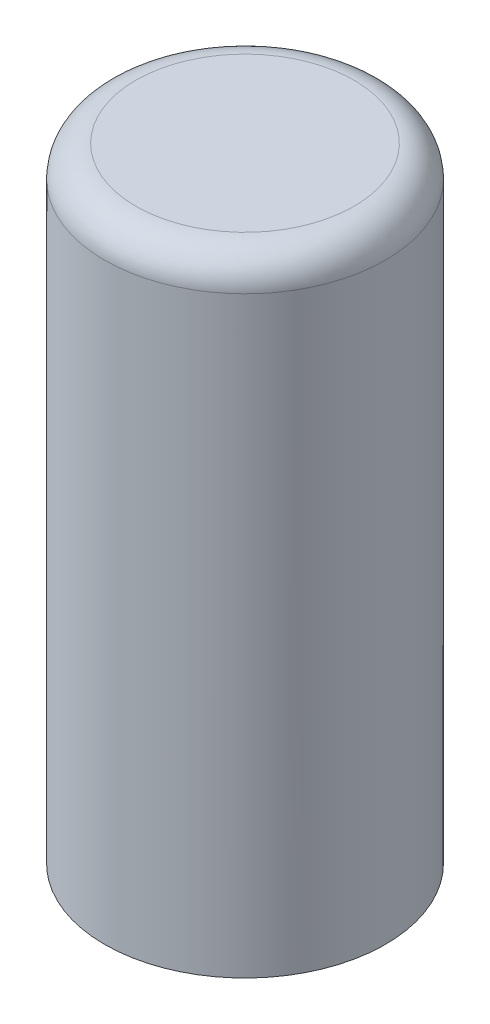
ISO-10303-21;
HEADER;
FILE_DESCRIPTION(('STEP AP214'),'2;1');
FILE_NAME('part.step','',(''),(''),'','','');
FILE_SCHEMA(('AUTOMOTIVE_DESIGN { 1 0 10303 214 1 1 1 1 }'));
ENDSEC;
DATA;
#1=APPLICATION_CONTEXT('core data for automotive mechanical design processes');
#2=APPLICATION_PROTOCOL_DEFINITION('international standard','automotive_design',2000,#1);
#3=PRODUCT_CONTEXT('',#1,'mechanical');
#4=PRODUCT('Part','Part','',(#3));
#5=PRODUCT_RELATED_PRODUCT_CATEGORY('part','',(#4));
#6=PRODUCT_DEFINITION_FORMATION('','',#4);
#7=PRODUCT_DEFINITION_CONTEXT('part definition',#1,'design');
#8=PRODUCT_DEFINITION('design','',#6,#7);
#9=PRODUCT_DEFINITION_SHAPE('','',#8);
#10=(LENGTH_UNIT() NAMED_UNIT(*) SI_UNIT(.MILLI.,.METRE.));
#11=(NAMED_UNIT(*) PLANE_ANGLE_UNIT() SI_UNIT($,.RADIAN.));
#12=(NAMED_UNIT(*) SI_UNIT($,.STERADIAN.) SOLID_ANGLE_UNIT());
#13=UNCERTAINTY_MEASURE_WITH_UNIT(LENGTH_MEASURE(1.E-05),#10,'distance_accuracy_value','');
#14=(GEOMETRIC_REPRESENTATION_CONTEXT(3) GLOBAL_UNCERTAINTY_ASSIGNED_CONTEXT((#13)) GLOBAL_UNIT_ASSIGNED_CONTEXT((#10,
#11,#12)) REPRESENTATION_CONTEXT('',''));
#15=CARTESIAN_POINT('',(0.,0.,0.));
#16=DIRECTION('',(0.,0.,1.));
#17=DIRECTION('',(1.,0.,0.));
#18=AXIS2_PLACEMENT_3D('',#15,#16,#17);
#19=CARTESIAN_POINT('',(0.,-20.,0.));
#20=DIRECTION('',(0.,1.,0.));
#21=DIRECTION('',(0.,0.,1.));
#22=AXIS2_PLACEMENT_3D('',#19,#20,#21);
#23=CYLINDRICAL_SURFACE('',#22,3.);
#24=CARTESIAN_POINT('',(0.,-20.,0.));
#25=DIRECTION('',(0.,1.,0.));
#26=DIRECTION('',(0.,0.,1.));
#27=AXIS2_PLACEMENT_3D('',#24,#25,#26);
#28=CIRCLE('',#27,3.);
#29=CARTESIAN_POINT('',(0.,-20.,3.));
#30=VERTEX_POINT('',#29);
#31=EDGE_CURVE('E80',#30,#30,#28,.T.);
#32=ORIENTED_EDGE('',*,*,#31,.F.);
#33=EDGE_LOOP('',(#32));
#34=FACE_BOUND('',#33,.T.);
#35=CARTESIAN_POINT('',(0.,-2.,0.));
#36=DIRECTION('',(0.,1.,0.));
#37=DIRECTION('',(0.,0.,1.));
#38=AXIS2_PLACEMENT_3D('',#35,#36,#37);
#39=CIRCLE('',#38,3.);
#40=CARTESIAN_POINT('',(0.,-2.,3.));
#41=VERTEX_POINT('',#40);
#42=EDGE_CURVE('E68',#41,#41,#39,.F.);
#43=ORIENTED_EDGE('',*,*,#42,.F.);
#44=EDGE_LOOP('',(#43));
#45=FACE_BOUND('',#44,.T.);
#46=ADVANCED_FACE('F48',(#34,#45),#23,.F.);
#47=CARTESIAN_POINT('',(0.,-20.,0.));
#48=DIRECTION('',(0.,1.,0.));
#49=DIRECTION('',(0.,0.,1.));
#50=AXIS2_PLACEMENT_3D('',#47,#48,#49);
#51=CYLINDRICAL_SURFACE('',#50,4.5);
#52=CARTESIAN_POINT('',(0.,-1.,4.5));
#53=CARTESIAN_POINT('',(0.589048617699849,-1.,4.5));
#54=CARTESIAN_POINT('',(1.17786548409566,-1.,4.3828770431522));
#55=CARTESIAN_POINT('',(2.26628540719015,-1.,3.93203874944938));
#56=CARTESIAN_POINT('',(2.76546024331536,-1.,3.59850078736357));
#57=CARTESIAN_POINT('',(3.59850078736357,-1.,2.76546024331536));
#58=CARTESIAN_POINT('',(3.93203874944955,-1.,2.26628540718974));
#59=CARTESIAN_POINT('',(4.38287704315203,-1.,1.17786548409606));
#60=CARTESIAN_POINT('',(4.5,-1.,0.58904861769995));
#61=CARTESIAN_POINT('',(4.5,-1.,-0.589048617699949));
#62=CARTESIAN_POINT('',(4.38287704315209,-1.,-1.17786548409592));
#63=CARTESIAN_POINT('',(3.93203874944949,-1.,-2.26628540718989));
#64=CARTESIAN_POINT('',(3.59850078736374,-1.,-2.76546024331519));
#65=CARTESIAN_POINT('',(2.76546024331519,-1.,-3.59850078736374));
#66=CARTESIAN_POINT('',(2.26628540718999,-1.,-3.93203874944945));
#67=CARTESIAN_POINT('',(1.17786548409583,-1.,-4.38287704315213));
#68=CARTESIAN_POINT('',(0.589048617699361,-1.,-4.5));
#69=CARTESIAN_POINT('',(-0.58904861769936,-1.,-4.5));
#70=CARTESIAN_POINT('',(-1.17786548409587,-1.,-4.38287704315211));
#71=CARTESIAN_POINT('',(-2.26628540718992,-1.,-3.93203874944948));
#72=CARTESIAN_POINT('',(-2.7654602433157,-1.,-3.59850078736323));
#73=CARTESIAN_POINT('',(-3.59850078736323,-1.,-2.7654602433157));
#74=CARTESIAN_POINT('',(-3.93203874944944,-1.,-2.26628540719));
#75=CARTESIAN_POINT('',(-4.38287704315214,-1.,-1.17786548409582));
#76=CARTESIAN_POINT('',(-4.5,-1.,-0.589048617699943));
#77=CARTESIAN_POINT('',(-4.5,-1.,0.589048617699957));
#78=CARTESIAN_POINT('',(-4.38287704315215,-1.,1.17786548409578));
#79=CARTESIAN_POINT('',(-3.93203874944944,-1.,2.26628540719001));
#80=CARTESIAN_POINT('',(-3.59850078736369,-1.,2.76546024331524));
#81=CARTESIAN_POINT('',(-2.76546024331526,-1.,3.59850078736367));
#82=CARTESIAN_POINT('',(-2.26628540719006,-1.,3.93203874944942));
#83=CARTESIAN_POINT('',(-1.17786548409576,-1.,4.38287704315216));
#84=CARTESIAN_POINT('',(-0.58904861769985,-1.,4.5));
#85=CARTESIAN_POINT('',(0.,-1.,4.5));
#86=(BOUNDED_CURVE() B_SPLINE_CURVE(3,(#52,#53,#54,#55,#56,#57,#58,#59,#60,#61,#62,#63,#64,#65,
#66,#67,#68,#69,#70,#71,#72,#73,#74,#75,#76,#77,#78,#79,#80,#81,#82,#83,#84,#85),.UNSPECIFIED.,
.T.,.F.) B_SPLINE_CURVE_WITH_KNOTS((4,2,2,2,2,2,2,2,2,2,2,2,2,2,2,2,4),(0.,0.392699081698724,
0.785398163397448,1.17809724509617,1.5707963267949,1.96349540849362,2.35619449019234,
2.74889357189107,3.14159265358979,3.53429173528852,3.92699081698724,4.31968989868597,
4.71238898038469,5.10508806208341,5.49778714378214,5.89048622548086,6.28318530717959),
.UNSPECIFIED.) CURVE() GEOMETRIC_REPRESENTATION_ITEM() RATIONAL_B_SPLINE_CURVE((1.,1.,1.,1.,1.,
1.,1.,1.,1.,1.,1.,1.,1.,1.,1.,1.,1.,1.,1.,1.,1.,1.,1.,1.,1.,1.,1.,1.,1.,1.,1.,1.,1.,1.)) REPRESENTATION_ITEM(''));
#87=CARTESIAN_POINT('',(0.,-1.,4.5));
#88=VERTEX_POINT('',#87);
#89=EDGE_CURVE('E11',#88,#88,#86,.F.);
#90=ORIENTED_EDGE('',*,*,#89,.T.);
#91=EDGE_LOOP('',(#90));
#92=FACE_BOUND('',#91,.T.);
#93=CARTESIAN_POINT('',(0.,-20.,0.));
#94=DIRECTION('',(0.,1.,0.));
#95=DIRECTION('',(0.,0.,1.));
#96=AXIS2_PLACEMENT_3D('',#93,#94,#95);
#97=CIRCLE('',#96,4.5);
#98=CARTESIAN_POINT('',(0.,-20.,4.5));
#99=VERTEX_POINT('',#98);
#100=EDGE_CURVE('E74',#99,#99,#97,.T.);
#101=ORIENTED_EDGE('',*,*,#100,.T.);
#102=EDGE_LOOP('',(#101));
#103=FACE_BOUND('',#102,.T.);
#104=ADVANCED_FACE('F100',(#92,#103),#51,.T.);
#105=CARTESIAN_POINT('',(0.,-20.,0.));
#106=DIRECTION('',(0.,1.,0.));
#107=DIRECTION('',(0.,0.,1.));
#108=AXIS2_PLACEMENT_3D('',#105,#106,#107);
#109=PLANE('',#108);
#110=ORIENTED_EDGE('',*,*,#31,.T.);
#111=EDGE_LOOP('',(#110));
#112=FACE_BOUND('',#111,.T.);
#113=ORIENTED_EDGE('',*,*,#100,.F.);
#114=EDGE_LOOP('',(#113));
#115=FACE_BOUND('',#114,.T.);
#116=ADVANCED_FACE('F98',(#112,#115),#109,.F.);
#117=CARTESIAN_POINT('',(0.,0.,0.));
#118=DIRECTION('',(0.,1.,0.));
#119=DIRECTION('',(0.,0.,1.));
#120=AXIS2_PLACEMENT_3D('',#117,#118,#119);
#121=PLANE('',#120);
#122=CARTESIAN_POINT('',(0.,0.,3.5));
#123=CARTESIAN_POINT('',(-0.458148924877661,0.,3.50000000000013));
#124=CARTESIAN_POINT('',(-0.916117598741248,0.,3.40890436689621));
#125=CARTESIAN_POINT('',(-1.76266642781439,0.,3.0582523606828));
#126=CARTESIAN_POINT('',(-2.15091352257853,0.,2.7988339457273));
#127=CARTESIAN_POINT('',(-2.79883394572732,0.,2.15091352257851));
#128=CARTESIAN_POINT('',(-3.05825236068306,0.,1.76266642781438));
#129=CARTESIAN_POINT('',(-3.40890436689596,0.,0.916117598741238));
#130=CARTESIAN_POINT('',(-3.5,0.,0.458148924877745));
#131=CARTESIAN_POINT('',(-3.5,0.,-0.458148924877733));
#132=CARTESIAN_POINT('',(-3.40890436689621,0.,-0.916117598741248));
#133=CARTESIAN_POINT('',(-3.0582523606828,0.,-1.76266642781439));
#134=CARTESIAN_POINT('',(-2.79883394572718,0.,-2.15091352257853));
#135=CARTESIAN_POINT('',(-2.15091352257866,0.,-2.7988339457273));
#136=CARTESIAN_POINT('',(-1.76266642781443,0.,-3.0582523606829));
#137=CARTESIAN_POINT('',(-0.916117598741191,0.,-3.40890436689612));
#138=CARTESIAN_POINT('',(-0.458148924877738,0.,-3.5));
#139=CARTESIAN_POINT('',(0.458148924877739,0.,-3.5));
#140=CARTESIAN_POINT('',(0.9161175987412,0.,-3.40890436689611));
#141=CARTESIAN_POINT('',(1.76266642781444,0.,-3.05825236068289));
#142=CARTESIAN_POINT('',(2.15091352257853,0.,-2.79883394572731));
#143=CARTESIAN_POINT('',(2.7988339457273,0.,-2.15091352257853));
#144=CARTESIAN_POINT('',(3.05825236068285,0.,-1.76266642781435));
#145=CARTESIAN_POINT('',(3.40890436689616,0.,-0.916117598741285));
#146=CARTESIAN_POINT('',(3.49999999999987,0.,-0.458148924877738));
#147=CARTESIAN_POINT('',(3.50000000000013,0.,0.458148924877739));
#148=CARTESIAN_POINT('',(3.40890436689604,0.,0.916117598741282));
#149=CARTESIAN_POINT('',(3.05825236068298,0.,1.76266642781434));
#150=CARTESIAN_POINT('',(2.79883394572721,0.,2.15091352257862));
#151=CARTESIAN_POINT('',(2.15091352257862,0.,2.79883394572721));
#152=CARTESIAN_POINT('',(1.76266642781452,0.,3.05825236068293));
#153=CARTESIAN_POINT('',(0.916117598741112,0.,3.40890436689607));
#154=CARTESIAN_POINT('',(0.458148924877661,0.,3.49999999999987));
#155=CARTESIAN_POINT('',(0.,0.,3.5));
#156=(BOUNDED_CURVE() B_SPLINE_CURVE(3,(#122,#123,#124,#125,#126,#127,#128,#129,#130,#131,#132,
#133,#134,#135,#136,#137,#138,#139,#140,#141,#142,#143,#144,#145,#146,#147,#148,#149,#150,#151,
#152,#153,#154,#155),.UNSPECIFIED.,.T.,.F.) B_SPLINE_CURVE_WITH_KNOTS((4,2,2,2,2,2,2,2,2,2,2,2,
2,2,2,2,4),(0.,0.392699081698725,0.785398163397448,1.17809724509617,1.5707963267949,
1.96349540849362,2.35619449019234,2.74889357189107,3.14159265358979,3.53429173528852,
3.92699081698724,4.31968989868597,4.71238898038469,5.10508806208341,5.49778714378214,
5.89048622548086,6.28318530717959),
.UNSPECIFIED.) CURVE() GEOMETRIC_REPRESENTATION_ITEM() RATIONAL_B_SPLINE_CURVE((1.,1.,1.,1.,1.,
1.,1.,1.,1.,1.,1.,1.,1.,1.,1.,1.,1.,1.,1.,1.,1.,1.,1.,1.,1.,1.,1.,1.,1.,1.,1.,1.,1.,1.)) REPRESENTATION_ITEM(''));
#157=CARTESIAN_POINT('',(0.,0.,3.5));
#158=VERTEX_POINT('',#157);
#159=EDGE_CURVE('E62',#158,#158,#156,.F.);
#160=ORIENTED_EDGE('',*,*,#159,.T.);
#161=EDGE_LOOP('',(#160));
#162=FACE_BOUND('',#161,.T.);
#163=ADVANCED_FACE('F88',(#162),#121,.T.);
#164=CARTESIAN_POINT('',(0.,-2.,0.));
#165=DIRECTION('',(0.,1.,0.));
#166=DIRECTION('',(0.,0.,1.));
#167=AXIS2_PLACEMENT_3D('',#164,#165,#166);
#168=PLANE('',#167);
#169=ORIENTED_EDGE('',*,*,#42,.T.);
#170=EDGE_LOOP('',(#169));
#171=FACE_BOUND('',#170,.T.);
#172=ADVANCED_FACE('F97',(#171),#168,.F.);
#173=CARTESIAN_POINT('',(0.,0.,3.5));
#174=CARTESIAN_POINT('',(0.458148924877661,0.,3.49999999999987));
#175=CARTESIAN_POINT('',(0.916117598741112,0.,3.40890436689607));
#176=CARTESIAN_POINT('',(1.76266642781452,0.,3.05825236068293));
#177=CARTESIAN_POINT('',(2.15091352257862,0.,2.79883394572721));
#178=CARTESIAN_POINT('',(2.79883394572721,0.,2.15091352257862));
#179=CARTESIAN_POINT('',(3.05825236068298,0.,1.76266642781434));
#180=CARTESIAN_POINT('',(3.40890436689604,0.,0.916117598741282));
#181=CARTESIAN_POINT('',(3.50000000000013,0.,0.458148924877739));
#182=CARTESIAN_POINT('',(3.49999999999987,0.,-0.458148924877738));
#183=CARTESIAN_POINT('',(3.40890436689616,0.,-0.916117598741285));
#184=CARTESIAN_POINT('',(3.05825236068285,0.,-1.76266642781435));
#185=CARTESIAN_POINT('',(2.7988339457273,0.,-2.15091352257853));
#186=CARTESIAN_POINT('',(2.15091352257853,0.,-2.79883394572731));
#187=CARTESIAN_POINT('',(1.76266642781444,0.,-3.05825236068289));
#188=CARTESIAN_POINT('',(0.9161175987412,0.,-3.40890436689611));
#189=CARTESIAN_POINT('',(0.458148924877739,0.,-3.5));
#190=CARTESIAN_POINT('',(-0.458148924877738,0.,-3.5));
#191=CARTESIAN_POINT('',(-0.916117598741191,0.,-3.40890436689612));
#192=CARTESIAN_POINT('',(-1.76266642781443,0.,-3.0582523606829));
#193=CARTESIAN_POINT('',(-2.15091352257866,0.,-2.7988339457273));
#194=CARTESIAN_POINT('',(-2.79883394572718,0.,-2.15091352257853));
#195=CARTESIAN_POINT('',(-3.0582523606828,0.,-1.76266642781439));
#196=CARTESIAN_POINT('',(-3.40890436689621,0.,-0.916117598741248));
#197=CARTESIAN_POINT('',(-3.5,0.,-0.458148924877733));
#198=CARTESIAN_POINT('',(-3.5,0.,0.458148924877745));
#199=CARTESIAN_POINT('',(-3.40890436689596,0.,0.916117598741238));
#200=CARTESIAN_POINT('',(-3.05825236068306,0.,1.76266642781438));
#201=CARTESIAN_POINT('',(-2.79883394572732,0.,2.15091352257851));
#202=CARTESIAN_POINT('',(-2.15091352257853,0.,2.7988339457273));
#203=CARTESIAN_POINT('',(-1.76266642781439,0.,3.0582523606828));
#204=CARTESIAN_POINT('',(-0.916117598741248,0.,3.40890436689621));
#205=CARTESIAN_POINT('',(-0.458148924877661,0.,3.50000000000013));
#206=CARTESIAN_POINT('',(0.,0.,3.5));
#207=CARTESIAN_POINT('',(0.,0.,4.5));
#208=CARTESIAN_POINT('',(0.58904861769985,1.2816324012224E-13,4.49999999999975));
#209=CARTESIAN_POINT('',(1.17786548409576,0.,4.38287704315228));
#210=CARTESIAN_POINT('',(2.26628540719005,0.,3.9320387494493));
#211=CARTESIAN_POINT('',(2.7654602433153,0.,3.5985007873635));
#212=CARTESIAN_POINT('',(3.59850078736363,0.,2.76546024331543));
#213=CARTESIAN_POINT('',(3.9320387494497,0.,2.26628540718981));
#214=CARTESIAN_POINT('',(4.38287704315188,0.,1.177865484096));
#215=CARTESIAN_POINT('',(4.50000000000026,-1.27295878384308E-13,0.58904861769995));
#216=CARTESIAN_POINT('',(4.49999999999975,1.28163240122296E-13,-0.589048617699949));
#217=CARTESIAN_POINT('',(4.38287704315214,0.,-1.17786548409594));
#218=CARTESIAN_POINT('',(3.93203874944945,0.,-2.26628540718987));
#219=CARTESIAN_POINT('',(3.59850078736367,0.,-2.76546024331513));
#220=CARTESIAN_POINT('',(2.76546024331525,0.,-3.59850078736381));
#221=CARTESIAN_POINT('',(2.26628540718985,-1.27729559253175E-13,-3.93203874944941));
#222=CARTESIAN_POINT('',(1.17786548409597,1.27729559253175E-13,-4.38287704315216));
#223=CARTESIAN_POINT('',(0.589048617699361,0.,-4.5));
#224=CARTESIAN_POINT('',(-0.58904861769936,0.,-4.5));
#225=CARTESIAN_POINT('',(-1.1778654840959,0.,-4.38287704315217));
#226=CARTESIAN_POINT('',(-2.2662854071899,0.,-3.93203874944942));
#227=CARTESIAN_POINT('',(-2.76546024331576,0.,-3.59850078736342));
#228=CARTESIAN_POINT('',(-3.59850078736317,0.,-2.76546024331551));
#229=CARTESIAN_POINT('',(-3.93203874944922,1.2772955925343E-13,-2.26628540718985));
#230=CARTESIAN_POINT('',(-4.38287704315236,-1.2772955925343E-13,-1.17786548409597));
#231=CARTESIAN_POINT('',(-4.5,0.,-0.589048617699943));
#232=CARTESIAN_POINT('',(-4.5,0.,0.589048617699957));
#233=CARTESIAN_POINT('',(-4.38287704315211,-1.2772955925343E-13,1.1778654840957));
#234=CARTESIAN_POINT('',(-3.93203874944948,1.2772955925343E-13,2.26628540719009));
#235=CARTESIAN_POINT('',(-3.59850078736362,0.,2.76546024331518));
#236=CARTESIAN_POINT('',(-2.76546024331532,0.,3.59850078736373));
#237=CARTESIAN_POINT('',(-2.26628540718998,1.27295878384436E-13,3.93203874944922));
#238=CARTESIAN_POINT('',(-1.17786548409585,-1.28163240122424E-13,4.38287704315236));
#239=CARTESIAN_POINT('',(-0.58904861769985,-1.27295878384252E-13,4.50000000000026));
#240=CARTESIAN_POINT('',(0.,0.,4.5));
#241=CARTESIAN_POINT('',(0.,-1.,4.5));
#242=CARTESIAN_POINT('',(0.589048617699849,-1.,4.5));
#243=CARTESIAN_POINT('',(1.17786548409566,-1.,4.3828770431522));
#244=CARTESIAN_POINT('',(2.26628540719015,-1.,3.93203874944938));
#245=CARTESIAN_POINT('',(2.76546024331536,-1.,3.59850078736357));
#246=CARTESIAN_POINT('',(3.59850078736357,-1.,2.76546024331536));
#247=CARTESIAN_POINT('',(3.93203874944955,-1.,2.26628540718974));
#248=CARTESIAN_POINT('',(4.38287704315203,-1.,1.17786548409606));
#249=CARTESIAN_POINT('',(4.5,-1.,0.58904861769995));
#250=CARTESIAN_POINT('',(4.5,-1.,-0.589048617699949));
#251=CARTESIAN_POINT('',(4.38287704315209,-1.,-1.17786548409592));
#252=CARTESIAN_POINT('',(3.93203874944949,-1.,-2.26628540718989));
#253=CARTESIAN_POINT('',(3.59850078736374,-1.,-2.76546024331519));
#254=CARTESIAN_POINT('',(2.76546024331519,-1.,-3.59850078736374));
#255=CARTESIAN_POINT('',(2.26628540718999,-1.,-3.93203874944945));
#256=CARTESIAN_POINT('',(1.17786548409583,-1.,-4.38287704315213));
#257=CARTESIAN_POINT('',(0.589048617699361,-1.,-4.5));
#258=CARTESIAN_POINT('',(-0.58904861769936,-1.,-4.5));
#259=CARTESIAN_POINT('',(-1.17786548409587,-1.,-4.38287704315211));
#260=CARTESIAN_POINT('',(-2.26628540718992,-1.,-3.93203874944948));
#261=CARTESIAN_POINT('',(-2.7654602433157,-1.,-3.59850078736323));
#262=CARTESIAN_POINT('',(-3.59850078736323,-1.,-2.7654602433157));
#263=CARTESIAN_POINT('',(-3.93203874944944,-1.,-2.26628540719));
#264=CARTESIAN_POINT('',(-4.38287704315214,-1.,-1.17786548409582));
#265=CARTESIAN_POINT('',(-4.5,-1.,-0.589048617699943));
#266=CARTESIAN_POINT('',(-4.5,-1.,0.589048617699957));
#267=CARTESIAN_POINT('',(-4.38287704315215,-1.,1.17786548409578));
#268=CARTESIAN_POINT('',(-3.93203874944944,-1.,2.26628540719001));
#269=CARTESIAN_POINT('',(-3.59850078736369,-1.,2.76546024331524));
#270=CARTESIAN_POINT('',(-2.76546024331526,-1.,3.59850078736367));
#271=CARTESIAN_POINT('',(-2.26628540719006,-1.,3.93203874944942));
#272=CARTESIAN_POINT('',(-1.17786548409576,-1.,4.38287704315216));
#273=CARTESIAN_POINT('',(-0.58904861769985,-1.,4.5));
#274=CARTESIAN_POINT('',(0.,-1.,4.5));
#275=(BOUNDED_SURFACE() B_SPLINE_SURFACE(2,3,((#173,#174,#175,#176,#177,#178,#179,#180,#181,
#182,#183,#184,#185,#186,#187,#188,#189,#190,#191,#192,#193,#194,#195,#196,#197,#198,#199,#200,
#201,#202,#203,#204,#205,#206),(#207,#208,#209,#210,#211,#212,#213,#214,#215,#216,#217,#218,
#219,#220,#221,#222,#223,#224,#225,#226,#227,#228,#229,#230,#231,#232,#233,#234,#235,#236,#237,
#238,#239,#240),(#241,#242,#243,#244,#245,#246,#247,#248,#249,#250,#251,#252,#253,#254,#255,
#256,#257,#258,#259,#260,#261,#262,#263,#264,#265,#266,#267,#268,#269,#270,#271,#272,#273,
#274)),.UNSPECIFIED.,.F.,.T.,.F.) B_SPLINE_SURFACE_WITH_KNOTS((3,3),(4,2,2,2,2,2,2,2,2,2,2,2,2,
2,2,2,4),(0.,1.),(0.,0.392699081698724,0.785398163397448,1.17809724509617,1.5707963267949,
1.96349540849362,2.35619449019234,2.74889357189107,3.14159265358979,3.53429173528852,
3.92699081698724,4.31968989868597,4.71238898038469,5.10508806208341,5.49778714378214,
5.89048622548086,6.28318530717959),
.UNSPECIFIED.) GEOMETRIC_REPRESENTATION_ITEM() RATIONAL_B_SPLINE_SURFACE(((1.,1.,1.,1.,1.,1.,1.,
1.,1.,1.,1.,1.,1.,1.,1.,1.,1.,1.,1.,1.,1.,1.,1.,1.,1.,1.,1.,1.,1.,1.,1.,1.,1.,1.),
(0.707106781186547,0.707106781186547,0.707106781186547,0.707106781186547,0.707106781186547,
0.707106781186547,0.707106781186547,0.707106781186547,0.707106781186547,0.707106781186547,
0.707106781186547,0.707106781186547,0.707106781186547,0.707106781186547,0.707106781186547,
0.707106781186547,0.707106781186547,0.707106781186547,0.707106781186547,0.707106781186547,
0.707106781186547,0.707106781186547,0.707106781186547,0.707106781186547,0.707106781186547,
0.707106781186547,0.707106781186547,0.707106781186547,0.707106781186547,0.707106781186547,
0.707106781186547,0.707106781186547,0.707106781186547,0.707106781186547),(1.,1.,1.,1.,1.,1.,1.,
1.,1.,1.,1.,1.,1.,1.,1.,1.,1.,1.,1.,1.,1.,1.,1.,1.,1.,1.,1.,1.,1.,1.,1.,1.,1.,1.))) REPRESENTATION_ITEM('') SURFACE());
#276=ORIENTED_EDGE('',*,*,#89,.F.);
#277=EDGE_LOOP('',(#276));
#278=FACE_BOUND('',#277,.T.);
#279=ORIENTED_EDGE('',*,*,#159,.F.);
#280=EDGE_LOOP('',(#279));
#281=FACE_BOUND('',#280,.T.);
#282=ADVANCED_FACE('F51',(#278,#281),#275,.T.);
#283=CLOSED_SHELL('',(#46,#104,#116,#163,#172,#282));
#284=MANIFOLD_SOLID_BREP('B2',#283);
#285=ADVANCED_BREP_SHAPE_REPRESENTATION('',(#18,#284),#14);
#286=SHAPE_DEFINITION_REPRESENTATION(#9,#285);
ENDSEC;
END-ISO-10303-21;
